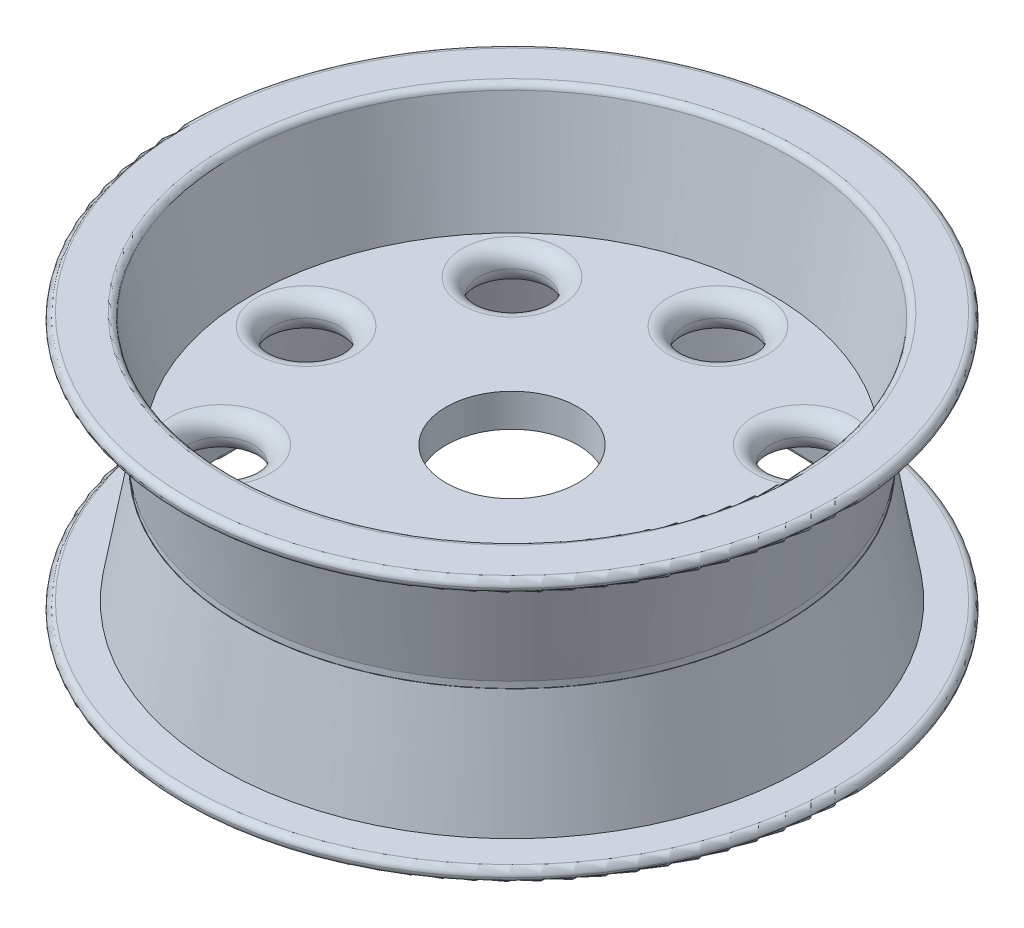
ISO-10303-21;
HEADER;
FILE_DESCRIPTION(('STEP AP214'),'2;1');
FILE_NAME('part.step','',(''),(''),'','','');
FILE_SCHEMA(('AUTOMOTIVE_DESIGN { 1 0 10303 214 1 1 1 1 }'));
ENDSEC;
DATA;
#1=APPLICATION_CONTEXT('core data for automotive mechanical design processes');
#2=APPLICATION_PROTOCOL_DEFINITION('international standard','automotive_design',2000,#1);
#3=PRODUCT_CONTEXT('',#1,'mechanical');
#4=PRODUCT('Part','Part','',(#3));
#5=PRODUCT_RELATED_PRODUCT_CATEGORY('part','',(#4));
#6=PRODUCT_DEFINITION_FORMATION('','',#4);
#7=PRODUCT_DEFINITION_CONTEXT('part definition',#1,'design');
#8=PRODUCT_DEFINITION('design','',#6,#7);
#9=PRODUCT_DEFINITION_SHAPE('','',#8);
#10=(LENGTH_UNIT() NAMED_UNIT(*) SI_UNIT(.MILLI.,.METRE.));
#11=(NAMED_UNIT(*) PLANE_ANGLE_UNIT() SI_UNIT($,.RADIAN.));
#12=(NAMED_UNIT(*) SI_UNIT($,.STERADIAN.) SOLID_ANGLE_UNIT());
#13=UNCERTAINTY_MEASURE_WITH_UNIT(LENGTH_MEASURE(1.E-05),#10,'distance_accuracy_value','');
#14=(GEOMETRIC_REPRESENTATION_CONTEXT(3) GLOBAL_UNCERTAINTY_ASSIGNED_CONTEXT((#13)) GLOBAL_UNIT_ASSIGNED_CONTEXT((#10,
#11,#12)) REPRESENTATION_CONTEXT('',''));
#15=CARTESIAN_POINT('',(0.,0.,0.));
#16=DIRECTION('',(0.,0.,1.));
#17=DIRECTION('',(1.,0.,0.));
#18=AXIS2_PLACEMENT_3D('',#15,#16,#17);
#19=CARTESIAN_POINT('',(100.,41.,0.));
#20=DIRECTION('',(0.,1.,0.));
#21=DIRECTION('',(0.,0.,1.));
#22=AXIS2_PLACEMENT_3D('',#19,#20,#21);
#23=PLANE('',#22);
#24=CARTESIAN_POINT('',(100.,41.,0.));
#25=DIRECTION('',(0.,1.,0.));
#26=DIRECTION('',(0.,0.,1.));
#27=AXIS2_PLACEMENT_3D('',#24,#25,#26);
#28=CIRCLE('',#27,82.1849541999128);
#29=CARTESIAN_POINT('',(100.,41.,82.1849541999128));
#30=VERTEX_POINT('',#29);
#31=EDGE_CURVE('E173',#30,#30,#28,.T.);
#32=ORIENTED_EDGE('',*,*,#31,.F.);
#33=EDGE_LOOP('',(#32));
#34=FACE_BOUND('',#33,.T.);
#35=CARTESIAN_POINT('',(100.,40.9999999999968,0.));
#36=DIRECTION('',(0.,1.,0.));
#37=DIRECTION('',(0.,0.,1.));
#38=AXIS2_PLACEMENT_3D('',#35,#36,#37);
#39=CIRCLE('',#38,82.04866226769);
#40=CARTESIAN_POINT('',(100.,40.9999999999968,82.04866226769));
#41=VERTEX_POINT('',#40);
#42=EDGE_CURVE('E155',#41,#41,#39,.F.);
#43=ORIENTED_EDGE('',*,*,#42,.F.);
#44=EDGE_LOOP('',(#43));
#45=FACE_BOUND('',#44,.T.);
#46=ADVANCED_FACE('F44',(#34,#45),#23,.F.);
#47=CARTESIAN_POINT('',(100.,39.,0.));
#48=DIRECTION('',(0.,-1.,0.));
#49=DIRECTION('',(0.,0.,-1.));
#50=AXIS2_PLACEMENT_3D('',#47,#48,#49);
#51=PLANE('',#50);
#52=CARTESIAN_POINT('',(100.,39.,0.));
#53=DIRECTION('',(0.,-1.,0.));
#54=DIRECTION('',(0.,0.,-1.));
#55=AXIS2_PLACEMENT_3D('',#52,#53,#54);
#56=CIRCLE('',#55,82.1849541999128);
#57=CARTESIAN_POINT('',(100.,39.,-82.1849541999128));
#58=VERTEX_POINT('',#57);
#59=EDGE_CURVE('E177',#58,#58,#56,.T.);
#60=ORIENTED_EDGE('',*,*,#59,.F.);
#61=EDGE_LOOP('',(#60));
#62=FACE_BOUND('',#61,.T.);
#63=CARTESIAN_POINT('',(100.,38.9999999999873,0.));
#64=DIRECTION('',(0.,-1.,0.));
#65=DIRECTION('',(0.,0.,-1.));
#66=AXIS2_PLACEMENT_3D('',#63,#64,#65);
#67=CIRCLE('',#66,82.04866226769);
#68=CARTESIAN_POINT('',(100.,38.9999999999873,-82.04866226769));
#69=VERTEX_POINT('',#68);
#70=EDGE_CURVE('E158',#69,#69,#67,.F.);
#71=ORIENTED_EDGE('',*,*,#70,.F.);
#72=EDGE_LOOP('',(#71));
#73=FACE_BOUND('',#72,.T.);
#74=ADVANCED_FACE('F190',(#62,#73),#51,.F.);
#75=CARTESIAN_POINT('',(100.,80.,0.));
#76=DIRECTION('',(0.,-1.,0.));
#77=DIRECTION('',(0.,0.,-1.));
#78=AXIS2_PLACEMENT_3D('',#75,#76,#77);
#79=CYLINDRICAL_SURFACE('',#78,20.);
#80=CARTESIAN_POINT('',(100.,45.,0.));
#81=DIRECTION('',(0.,1.,0.));
#82=DIRECTION('',(0.,0.,1.));
#83=AXIS2_PLACEMENT_3D('',#80,#81,#82);
#84=CIRCLE('',#83,20.);
#85=CARTESIAN_POINT('',(100.,45.,20.));
#86=VERTEX_POINT('',#85);
#87=EDGE_CURVE('E161',#86,#86,#84,.T.);
#88=ORIENTED_EDGE('',*,*,#87,.T.);
#89=EDGE_LOOP('',(#88));
#90=FACE_BOUND('',#89,.T.);
#91=CARTESIAN_POINT('',(100.,35.,0.));
#92=DIRECTION('',(0.,-1.,0.));
#93=DIRECTION('',(0.,0.,-1.));
#94=AXIS2_PLACEMENT_3D('',#91,#92,#93);
#95=CIRCLE('',#94,20.);
#96=CARTESIAN_POINT('',(100.,35.,-20.));
#97=VERTEX_POINT('',#96);
#98=EDGE_CURVE('E167',#97,#97,#95,.T.);
#99=ORIENTED_EDGE('',*,*,#98,.T.);
#100=EDGE_LOOP('',(#99));
#101=FACE_BOUND('',#100,.T.);
#102=ADVANCED_FACE('F203',(#90,#101),#79,.F.);
#103=CARTESIAN_POINT('',(100.,80.,0.));
#104=DIRECTION('',(0.,1.,0.));
#105=DIRECTION('',(0.,0.,1.));
#106=AXIS2_PLACEMENT_3D('',#103,#104,#105);
#107=PLANE('',#106);
#108=CARTESIAN_POINT('',(100.,80.,0.));
#109=DIRECTION('',(0.,1.,0.));
#110=DIRECTION('',(0.,0.,1.));
#111=AXIS2_PLACEMENT_3D('',#108,#109,#110);
#112=CIRCLE('',#111,86.6781992623545);
#113=CARTESIAN_POINT('',(100.,80.,86.6781992623545));
#114=VERTEX_POINT('',#113);
#115=EDGE_CURVE('E12',#114,#114,#112,.F.);
#116=ORIENTED_EDGE('',*,*,#115,.T.);
#117=EDGE_LOOP('',(#116));
#118=FACE_BOUND('',#117,.T.);
#119=CARTESIAN_POINT('',(100.,80.,0.));
#120=DIRECTION('',(0.,1.,0.));
#121=DIRECTION('',(0.,0.,1.));
#122=AXIS2_PLACEMENT_3D('',#119,#120,#121);
#123=CIRCLE('',#122,98.);
#124=CARTESIAN_POINT('',(100.,80.,98.));
#125=VERTEX_POINT('',#124);
#126=EDGE_CURVE('E152',#125,#125,#123,.T.);
#127=ORIENTED_EDGE('',*,*,#126,.T.);
#128=EDGE_LOOP('',(#127));
#129=FACE_BOUND('',#128,.T.);
#130=ADVANCED_FACE('F209',(#118,#129),#107,.T.);
#131=CARTESIAN_POINT('',(100.,0.,0.));
#132=DIRECTION('',(0.,1.,0.));
#133=DIRECTION('',(0.,0.,1.));
#134=AXIS2_PLACEMENT_3D('',#131,#132,#133);
#135=PLANE('',#134);
#136=CARTESIAN_POINT('',(100.,0.,0.));
#137=DIRECTION('',(0.,1.,0.));
#138=DIRECTION('',(0.,0.,1.));
#139=AXIS2_PLACEMENT_3D('',#136,#137,#138);
#140=CIRCLE('',#139,86.6781992623545);
#141=CARTESIAN_POINT('',(100.,0.,86.6781992623545));
#142=VERTEX_POINT('',#141);
#143=EDGE_CURVE('E55',#142,#142,#140,.T.);
#144=ORIENTED_EDGE('',*,*,#143,.T.);
#145=EDGE_LOOP('',(#144));
#146=FACE_BOUND('',#145,.T.);
#147=CARTESIAN_POINT('',(100.,0.,0.));
#148=DIRECTION('',(0.,1.,0.));
#149=DIRECTION('',(0.,0.,1.));
#150=AXIS2_PLACEMENT_3D('',#147,#148,#149);
#151=CIRCLE('',#150,98.);
#152=CARTESIAN_POINT('',(100.,0.,98.));
#153=VERTEX_POINT('',#152);
#154=EDGE_CURVE('E137',#153,#153,#151,.F.);
#155=ORIENTED_EDGE('',*,*,#154,.T.);
#156=EDGE_LOOP('',(#155));
#157=FACE_BOUND('',#156,.T.);
#158=ADVANCED_FACE('F230',(#146,#157),#135,.F.);
#159=CARTESIAN_POINT('',(100.,80.,0.));
#160=DIRECTION('',(0.,1.,0.));
#161=DIRECTION('',(0.,0.,1.));
#162=AXIS2_PLACEMENT_3D('',#159,#160,#161);
#163=CONICAL_SURFACE('',#162,85.,0.174532925199433);
#164=CARTESIAN_POINT('',(100.,78.3472963553339,0.));
#165=DIRECTION('',(0.,1.,0.));
#166=DIRECTION('',(0.,0.,1.));
#167=AXIS2_PLACEMENT_3D('',#164,#165,#166);
#168=CIRCLE('',#167,84.7085837563301);
#169=CARTESIAN_POINT('',(100.,78.3472963553339,84.7085837563301));
#170=VERTEX_POINT('',#169);
#171=EDGE_CURVE('E51',#170,#170,#168,.T.);
#172=ORIENTED_EDGE('',*,*,#171,.T.);
#173=EDGE_LOOP('',(#172));
#174=FACE_BOUND('',#173,.T.);
#175=CARTESIAN_POINT('',(100.,45.,0.));
#176=DIRECTION('',(0.,1.,0.));
#177=DIRECTION('',(0.,0.,1.));
#178=AXIS2_PLACEMENT_3D('',#175,#176,#177);
#179=CIRCLE('',#178,78.8285556752037);
#180=CARTESIAN_POINT('',(100.,45.,78.8285556752037));
#181=VERTEX_POINT('',#180);
#182=EDGE_CURVE('E164',#181,#181,#179,.T.);
#183=ORIENTED_EDGE('',*,*,#182,.F.);
#184=EDGE_LOOP('',(#183));
#185=FACE_BOUND('',#184,.T.);
#186=ADVANCED_FACE('F227',(#174,#185),#163,.F.);
#187=CARTESIAN_POINT('',(100.,45.,0.));
#188=DIRECTION('',(0.,1.,0.));
#189=DIRECTION('',(0.,0.,1.));
#190=AXIS2_PLACEMENT_3D('',#187,#188,#189);
#191=PLANE('',#190);
#192=CARTESIAN_POINT('',(100.,45.,-62.5));
#193=DIRECTION('',(0.,1.,0.));
#194=DIRECTION('',(0.,0.,1.));
#195=AXIS2_PLACEMENT_3D('',#192,#193,#194);
#196=CIRCLE('',#195,15.);
#197=CARTESIAN_POINT('',(100.,45.,-47.5));
#198=VERTEX_POINT('',#197);
#199=EDGE_CURVE('E64',#198,#198,#196,.F.);
#200=ORIENTED_EDGE('',*,*,#199,.T.);
#201=EDGE_LOOP('',(#200));
#202=FACE_BOUND('',#201,.T.);
#203=CARTESIAN_POINT('',(55.8058261758416,45.,-44.1941738241591));
#204=DIRECTION('',(0.,1.,0.));
#205=DIRECTION('',(0.,0.,1.));
#206=AXIS2_PLACEMENT_3D('',#203,#204,#205);
#207=CIRCLE('',#206,15.);
#208=CARTESIAN_POINT('',(55.8058261758416,45.,-29.1941738241591));
#209=VERTEX_POINT('',#208);
#210=EDGE_CURVE('E92',#209,#209,#207,.F.);
#211=ORIENTED_EDGE('',*,*,#210,.T.);
#212=EDGE_LOOP('',(#211));
#213=FACE_BOUND('',#212,.T.);
#214=CARTESIAN_POINT('',(37.5000000000009,45.,2.22044604925031E-13));
#215=DIRECTION('',(0.,1.,0.));
#216=DIRECTION('',(0.,0.,1.));
#217=AXIS2_PLACEMENT_3D('',#214,#215,#216);
#218=CIRCLE('',#217,15.);
#219=CARTESIAN_POINT('',(37.5000000000009,45.,15.0000000000002));
#220=VERTEX_POINT('',#219);
#221=EDGE_CURVE('E95',#220,#220,#218,.F.);
#222=ORIENTED_EDGE('',*,*,#221,.T.);
#223=EDGE_LOOP('',(#222));
#224=FACE_BOUND('',#223,.T.);
#225=CARTESIAN_POINT('',(55.8058261758419,45.,44.1941738241594));
#226=DIRECTION('',(0.,1.,0.));
#227=DIRECTION('',(0.,0.,1.));
#228=AXIS2_PLACEMENT_3D('',#225,#226,#227);
#229=CIRCLE('',#228,15.);
#230=CARTESIAN_POINT('',(55.8058261758419,45.,59.1941738241594));
#231=VERTEX_POINT('',#230);
#232=EDGE_CURVE('E98',#231,#231,#229,.F.);
#233=ORIENTED_EDGE('',*,*,#232,.T.);
#234=EDGE_LOOP('',(#233));
#235=FACE_BOUND('',#234,.T.);
#236=CARTESIAN_POINT('',(162.500000000001,45.,-6.66133814775094E-13));
#237=DIRECTION('',(0.,1.,0.));
#238=DIRECTION('',(0.,0.,1.));
#239=AXIS2_PLACEMENT_3D('',#236,#237,#238);
#240=CIRCLE('',#239,15.);
#241=CARTESIAN_POINT('',(162.500000000001,45.,14.9999999999993));
#242=VERTEX_POINT('',#241);
#243=EDGE_CURVE('E101',#242,#242,#240,.F.);
#244=ORIENTED_EDGE('',*,*,#243,.T.);
#245=EDGE_LOOP('',(#244));
#246=FACE_BOUND('',#245,.T.);
#247=CARTESIAN_POINT('',(100.000000000001,45.,62.5));
#248=DIRECTION('',(0.,1.,0.));
#249=DIRECTION('',(0.,0.,1.));
#250=AXIS2_PLACEMENT_3D('',#247,#248,#249);
#251=CIRCLE('',#250,15.);
#252=CARTESIAN_POINT('',(100.000000000001,45.,77.5));
#253=VERTEX_POINT('',#252);
#254=EDGE_CURVE('E104',#253,#253,#251,.F.);
#255=ORIENTED_EDGE('',*,*,#254,.T.);
#256=EDGE_LOOP('',(#255));
#257=FACE_BOUND('',#256,.T.);
#258=CARTESIAN_POINT('',(144.19417382416,45.,-44.1941738241598));
#259=DIRECTION('',(0.,1.,0.));
#260=DIRECTION('',(0.,0.,1.));
#261=AXIS2_PLACEMENT_3D('',#258,#259,#260);
#262=CIRCLE('',#261,15.);
#263=CARTESIAN_POINT('',(144.19417382416,45.,-29.1941738241598));
#264=VERTEX_POINT('',#263);
#265=EDGE_CURVE('E107',#264,#264,#262,.F.);
#266=ORIENTED_EDGE('',*,*,#265,.T.);
#267=EDGE_LOOP('',(#266));
#268=FACE_BOUND('',#267,.T.);
#269=CARTESIAN_POINT('',(144.194173824161,45.,44.1941738241588));
#270=DIRECTION('',(0.,1.,0.));
#271=DIRECTION('',(0.,0.,1.));
#272=AXIS2_PLACEMENT_3D('',#269,#270,#271);
#273=CIRCLE('',#272,15.);
#274=CARTESIAN_POINT('',(144.194173824161,45.,59.1941738241588));
#275=VERTEX_POINT('',#274);
#276=EDGE_CURVE('E110',#275,#275,#273,.F.);
#277=ORIENTED_EDGE('',*,*,#276,.T.);
#278=EDGE_LOOP('',(#277));
#279=FACE_BOUND('',#278,.T.);
#280=ORIENTED_EDGE('',*,*,#87,.F.);
#281=EDGE_LOOP('',(#280));
#282=FACE_BOUND('',#281,.T.);
#283=ORIENTED_EDGE('',*,*,#182,.T.);
#284=EDGE_LOOP('',(#283));
#285=FACE_BOUND('',#284,.T.);
#286=ADVANCED_FACE('F223',(#202,#213,#224,#235,#246,#257,#268,#279,#282,#285),#191,.T.);
#287=CARTESIAN_POINT('',(100.,0.,0.));
#288=DIRECTION('',(0.,-1.,0.));
#289=DIRECTION('',(0.,0.,-1.));
#290=AXIS2_PLACEMENT_3D('',#287,#288,#289);
#291=CONICAL_SURFACE('',#290,85.,0.174532925199433);
#292=CARTESIAN_POINT('',(100.,1.65270364466608,0.));
#293=DIRECTION('',(0.,1.,0.));
#294=DIRECTION('',(0.,0.,1.));
#295=AXIS2_PLACEMENT_3D('',#292,#293,#294);
#296=CIRCLE('',#295,84.7085837563301);
#297=CARTESIAN_POINT('',(100.,1.65270364466608,84.7085837563301));
#298=VERTEX_POINT('',#297);
#299=EDGE_CURVE('E59',#298,#298,#296,.F.);
#300=ORIENTED_EDGE('',*,*,#299,.T.);
#301=EDGE_LOOP('',(#300));
#302=FACE_BOUND('',#301,.T.);
#303=CARTESIAN_POINT('',(100.,35.,0.));
#304=DIRECTION('',(0.,-1.,0.));
#305=DIRECTION('',(0.,0.,-1.));
#306=AXIS2_PLACEMENT_3D('',#303,#304,#305);
#307=CIRCLE('',#306,78.8285556752037);
#308=CARTESIAN_POINT('',(100.,35.,-78.8285556752037));
#309=VERTEX_POINT('',#308);
#310=EDGE_CURVE('E170',#309,#309,#307,.T.);
#311=ORIENTED_EDGE('',*,*,#310,.F.);
#312=EDGE_LOOP('',(#311));
#313=FACE_BOUND('',#312,.T.);
#314=ADVANCED_FACE('F219',(#302,#313),#291,.F.);
#315=CARTESIAN_POINT('',(100.,35.,0.));
#316=DIRECTION('',(0.,-1.,0.));
#317=DIRECTION('',(0.,0.,-1.));
#318=AXIS2_PLACEMENT_3D('',#315,#316,#317);
#319=PLANE('',#318);
#320=CARTESIAN_POINT('',(100.,35.,-62.5));
#321=DIRECTION('',(0.,-1.,0.));
#322=DIRECTION('',(0.,0.,-1.));
#323=AXIS2_PLACEMENT_3D('',#320,#321,#322);
#324=CIRCLE('',#323,15.);
#325=CARTESIAN_POINT('',(100.,35.,-77.5));
#326=VERTEX_POINT('',#325);
#327=EDGE_CURVE('E113',#326,#326,#324,.F.);
#328=ORIENTED_EDGE('',*,*,#327,.T.);
#329=EDGE_LOOP('',(#328));
#330=FACE_BOUND('',#329,.T.);
#331=CARTESIAN_POINT('',(55.8058261758416,35.,-44.1941738241591));
#332=DIRECTION('',(0.,-1.,0.));
#333=DIRECTION('',(0.,0.,-1.));
#334=AXIS2_PLACEMENT_3D('',#331,#332,#333);
#335=CIRCLE('',#334,15.);
#336=CARTESIAN_POINT('',(55.8058261758416,35.,-59.1941738241591));
#337=VERTEX_POINT('',#336);
#338=EDGE_CURVE('E116',#337,#337,#335,.F.);
#339=ORIENTED_EDGE('',*,*,#338,.T.);
#340=EDGE_LOOP('',(#339));
#341=FACE_BOUND('',#340,.T.);
#342=CARTESIAN_POINT('',(37.5000000000009,35.,2.22044604925031E-13));
#343=DIRECTION('',(0.,-1.,0.));
#344=DIRECTION('',(0.,0.,-1.));
#345=AXIS2_PLACEMENT_3D('',#342,#343,#344);
#346=CIRCLE('',#345,15.);
#347=CARTESIAN_POINT('',(37.5000000000009,35.,-14.9999999999998));
#348=VERTEX_POINT('',#347);
#349=EDGE_CURVE('E119',#348,#348,#346,.F.);
#350=ORIENTED_EDGE('',*,*,#349,.T.);
#351=EDGE_LOOP('',(#350));
#352=FACE_BOUND('',#351,.T.);
#353=CARTESIAN_POINT('',(55.8058261758419,35.,44.1941738241594));
#354=DIRECTION('',(0.,-1.,0.));
#355=DIRECTION('',(0.,0.,-1.));
#356=AXIS2_PLACEMENT_3D('',#353,#354,#355);
#357=CIRCLE('',#356,15.);
#358=CARTESIAN_POINT('',(55.8058261758419,35.,29.1941738241595));
#359=VERTEX_POINT('',#358);
#360=EDGE_CURVE('E122',#359,#359,#357,.F.);
#361=ORIENTED_EDGE('',*,*,#360,.T.);
#362=EDGE_LOOP('',(#361));
#363=FACE_BOUND('',#362,.T.);
#364=CARTESIAN_POINT('',(162.500000000001,35.,-6.66133814775094E-13));
#365=DIRECTION('',(0.,-1.,0.));
#366=DIRECTION('',(0.,0.,-1.));
#367=AXIS2_PLACEMENT_3D('',#364,#365,#366);
#368=CIRCLE('',#367,15.);
#369=CARTESIAN_POINT('',(162.500000000001,35.,-15.0000000000006));
#370=VERTEX_POINT('',#369);
#371=EDGE_CURVE('E125',#370,#370,#368,.F.);
#372=ORIENTED_EDGE('',*,*,#371,.T.);
#373=EDGE_LOOP('',(#372));
#374=FACE_BOUND('',#373,.T.);
#375=CARTESIAN_POINT('',(100.000000000001,35.,62.5));
#376=DIRECTION('',(0.,-1.,0.));
#377=DIRECTION('',(0.,0.,-1.));
#378=AXIS2_PLACEMENT_3D('',#375,#376,#377);
#379=CIRCLE('',#378,15.);
#380=CARTESIAN_POINT('',(100.000000000001,35.,47.5));
#381=VERTEX_POINT('',#380);
#382=EDGE_CURVE('E128',#381,#381,#379,.F.);
#383=ORIENTED_EDGE('',*,*,#382,.T.);
#384=EDGE_LOOP('',(#383));
#385=FACE_BOUND('',#384,.T.);
#386=CARTESIAN_POINT('',(144.19417382416,35.,-44.1941738241598));
#387=DIRECTION('',(0.,-1.,0.));
#388=DIRECTION('',(0.,0.,-1.));
#389=AXIS2_PLACEMENT_3D('',#386,#387,#388);
#390=CIRCLE('',#389,15.);
#391=CARTESIAN_POINT('',(144.19417382416,35.,-59.1941738241598));
#392=VERTEX_POINT('',#391);
#393=EDGE_CURVE('E131',#392,#392,#390,.F.);
#394=ORIENTED_EDGE('',*,*,#393,.T.);
#395=EDGE_LOOP('',(#394));
#396=FACE_BOUND('',#395,.T.);
#397=CARTESIAN_POINT('',(144.194173824161,35.,44.1941738241588));
#398=DIRECTION('',(0.,-1.,0.));
#399=DIRECTION('',(0.,0.,-1.));
#400=AXIS2_PLACEMENT_3D('',#397,#398,#399);
#401=CIRCLE('',#400,15.);
#402=CARTESIAN_POINT('',(144.194173824161,35.,29.1941738241588));
#403=VERTEX_POINT('',#402);
#404=EDGE_CURVE('E134',#403,#403,#401,.F.);
#405=ORIENTED_EDGE('',*,*,#404,.T.);
#406=EDGE_LOOP('',(#405));
#407=FACE_BOUND('',#406,.T.);
#408=ORIENTED_EDGE('',*,*,#98,.F.);
#409=EDGE_LOOP('',(#408));
#410=FACE_BOUND('',#409,.T.);
#411=ORIENTED_EDGE('',*,*,#310,.T.);
#412=EDGE_LOOP('',(#411));
#413=FACE_BOUND('',#412,.T.);
#414=ADVANCED_FACE('F215',(#330,#341,#352,#363,#374,#385,#396,#407,#410,#413),#319,.T.);
#415=CARTESIAN_POINT('',(100.,76.,0.));
#416=DIRECTION('',(0.,1.,0.));
#417=DIRECTION('',(0.,0.,1.));
#418=AXIS2_PLACEMENT_3D('',#415,#416,#417);
#419=PLANE('',#418);
#420=CARTESIAN_POINT('',(100.,76.,0.));
#421=DIRECTION('',(0.,1.,0.));
#422=DIRECTION('',(0.,0.,1.));
#423=AXIS2_PLACEMENT_3D('',#420,#421,#422);
#424=CIRCLE('',#423,98.);
#425=CARTESIAN_POINT('',(100.,76.,98.));
#426=VERTEX_POINT('',#425);
#427=EDGE_CURVE('E149',#426,#426,#424,.F.);
#428=ORIENTED_EDGE('',*,*,#427,.T.);
#429=EDGE_LOOP('',(#428));
#430=FACE_BOUND('',#429,.T.);
#431=CARTESIAN_POINT('',(100.,76.,0.));
#432=DIRECTION('',(0.,1.,0.));
#433=DIRECTION('',(0.,0.,1.));
#434=AXIS2_PLACEMENT_3D('',#431,#432,#433);
#435=CIRCLE('',#434,88.3563985247091);
#436=CARTESIAN_POINT('',(100.,76.,88.3563985247091));
#437=VERTEX_POINT('',#436);
#438=EDGE_CURVE('E174',#437,#437,#435,.T.);
#439=ORIENTED_EDGE('',*,*,#438,.T.);
#440=EDGE_LOOP('',(#439));
#441=FACE_BOUND('',#440,.T.);
#442=ADVANCED_FACE('F218',(#430,#441),#419,.F.);
#443=CARTESIAN_POINT('',(100.,4.,0.));
#444=DIRECTION('',(0.,1.,0.));
#445=DIRECTION('',(0.,0.,1.));
#446=AXIS2_PLACEMENT_3D('',#443,#444,#445);
#447=PLANE('',#446);
#448=CARTESIAN_POINT('',(100.,4.,0.));
#449=DIRECTION('',(0.,1.,0.));
#450=DIRECTION('',(0.,0.,1.));
#451=AXIS2_PLACEMENT_3D('',#448,#449,#450);
#452=CIRCLE('',#451,98.);
#453=CARTESIAN_POINT('',(100.,4.,98.));
#454=VERTEX_POINT('',#453);
#455=EDGE_CURVE('E146',#454,#454,#452,.T.);
#456=ORIENTED_EDGE('',*,*,#455,.T.);
#457=EDGE_LOOP('',(#456));
#458=FACE_BOUND('',#457,.T.);
#459=CARTESIAN_POINT('',(100.,4.,0.));
#460=DIRECTION('',(0.,1.,0.));
#461=DIRECTION('',(0.,0.,1.));
#462=AXIS2_PLACEMENT_3D('',#459,#460,#461);
#463=CIRCLE('',#462,88.3563985247091);
#464=CARTESIAN_POINT('',(100.,4.,88.3563985247091));
#465=VERTEX_POINT('',#464);
#466=EDGE_CURVE('E143',#465,#465,#463,.F.);
#467=ORIENTED_EDGE('',*,*,#466,.T.);
#468=EDGE_LOOP('',(#467));
#469=FACE_BOUND('',#468,.T.);
#470=ADVANCED_FACE('F335',(#458,#469),#447,.T.);
#471=CARTESIAN_POINT('',(100.,79.3054072893323,0.));
#472=DIRECTION('',(0.,1.,0.));
#473=DIRECTION('',(0.,0.,1.));
#474=AXIS2_PLACEMENT_3D('',#471,#472,#473);
#475=CONICAL_SURFACE('',#474,88.9392310120488,0.174532925199433);
#476=ORIENTED_EDGE('',*,*,#31,.T.);
#477=EDGE_LOOP('',(#476));
#478=FACE_BOUND('',#477,.T.);
#479=ORIENTED_EDGE('',*,*,#438,.F.);
#480=EDGE_LOOP('',(#479));
#481=FACE_BOUND('',#480,.T.);
#482=ADVANCED_FACE('F185',(#478,#481),#475,.T.);
#483=CARTESIAN_POINT('',(100.,0.694592710667723,0.));
#484=DIRECTION('',(0.,-1.,0.));
#485=DIRECTION('',(0.,0.,-1.));
#486=AXIS2_PLACEMENT_3D('',#483,#484,#485);
#487=CONICAL_SURFACE('',#486,88.9392310120488,0.174532925199433);
#488=ORIENTED_EDGE('',*,*,#59,.T.);
#489=EDGE_LOOP('',(#488));
#490=FACE_BOUND('',#489,.T.);
#491=ORIENTED_EDGE('',*,*,#466,.F.);
#492=EDGE_LOOP('',(#491));
#493=FACE_BOUND('',#492,.T.);
#494=ADVANCED_FACE('F198',(#490,#493),#487,.T.);
#495=CARTESIAN_POINT('',(100.,-500000.,0.));
#496=DIRECTION('',(0.,1.,0.));
#497=DIRECTION('',(0.,0.,1.));
#498=AXIS2_PLACEMENT_3D('',#495,#496,#497);
#499=CYLINDRICAL_SURFACE('',#498,82.04866226769);
#500=ORIENTED_EDGE('',*,*,#42,.T.);
#501=EDGE_LOOP('',(#500));
#502=FACE_BOUND('',#501,.T.);
#503=ORIENTED_EDGE('',*,*,#70,.T.);
#504=EDGE_LOOP('',(#503));
#505=FACE_BOUND('',#504,.T.);
#506=ADVANCED_FACE('F194',(#502,#505),#499,.T.);
#507=CARTESIAN_POINT('',(100.,78.,0.));
#508=DIRECTION('',(0.,1.,0.));
#509=DIRECTION('',(0.,0.,1.));
#510=AXIS2_PLACEMENT_3D('',#507,#508,#509);
#511=TOROIDAL_SURFACE('',#510,98.,2.);
#512=ORIENTED_EDGE('',*,*,#427,.F.);
#513=EDGE_LOOP('',(#512));
#514=FACE_BOUND('',#513,.T.);
#515=CARTESIAN_POINT('',(100.,78.,0.));
#516=DIRECTION('',(0.,1.,0.));
#517=DIRECTION('',(0.,0.,1.));
#518=AXIS2_PLACEMENT_3D('',#515,#516,#517);
#519=CIRCLE('',#518,100.);
#520=CARTESIAN_POINT('',(100.,78.,100.));
#521=VERTEX_POINT('',#520);
#522=EDGE_CURVE('E140',#521,#521,#519,.T.);
#523=ORIENTED_EDGE('',*,*,#522,.F.);
#524=EDGE_LOOP('',(#523));
#525=FACE_BOUND('',#524,.T.);
#526=ADVANCED_FACE('F197',(#514,#525),#511,.T.);
#527=CARTESIAN_POINT('',(100.,78.,0.));
#528=DIRECTION('',(0.,1.,0.));
#529=DIRECTION('',(0.,0.,1.));
#530=AXIS2_PLACEMENT_3D('',#527,#528,#529);
#531=TOROIDAL_SURFACE('',#530,98.,2.);
#532=ORIENTED_EDGE('',*,*,#522,.T.);
#533=EDGE_LOOP('',(#532));
#534=FACE_BOUND('',#533,.T.);
#535=ORIENTED_EDGE('',*,*,#126,.F.);
#536=EDGE_LOOP('',(#535));
#537=FACE_BOUND('',#536,.T.);
#538=ADVANCED_FACE('F237',(#534,#537),#531,.T.);
#539=CARTESIAN_POINT('',(100.,2.,0.));
#540=DIRECTION('',(0.,1.,0.));
#541=DIRECTION('',(0.,0.,1.));
#542=AXIS2_PLACEMENT_3D('',#539,#540,#541);
#543=TOROIDAL_SURFACE('',#542,98.,2.);
#544=ORIENTED_EDGE('',*,*,#154,.F.);
#545=EDGE_LOOP('',(#544));
#546=FACE_BOUND('',#545,.T.);
#547=CARTESIAN_POINT('',(100.,2.,0.));
#548=DIRECTION('',(0.,1.,0.));
#549=DIRECTION('',(0.,0.,1.));
#550=AXIS2_PLACEMENT_3D('',#547,#548,#549);
#551=CIRCLE('',#550,100.);
#552=CARTESIAN_POINT('',(100.,2.,100.));
#553=VERTEX_POINT('',#552);
#554=EDGE_CURVE('E89',#553,#553,#551,.T.);
#555=ORIENTED_EDGE('',*,*,#554,.F.);
#556=EDGE_LOOP('',(#555));
#557=FACE_BOUND('',#556,.T.);
#558=ADVANCED_FACE('F240',(#546,#557),#543,.T.);
#559=CARTESIAN_POINT('',(100.,2.,0.));
#560=DIRECTION('',(0.,1.,0.));
#561=DIRECTION('',(0.,0.,1.));
#562=AXIS2_PLACEMENT_3D('',#559,#560,#561);
#563=TOROIDAL_SURFACE('',#562,98.,2.);
#564=ORIENTED_EDGE('',*,*,#554,.T.);
#565=EDGE_LOOP('',(#564));
#566=FACE_BOUND('',#565,.T.);
#567=ORIENTED_EDGE('',*,*,#455,.F.);
#568=EDGE_LOOP('',(#567));
#569=FACE_BOUND('',#568,.T.);
#570=ADVANCED_FACE('F245',(#566,#569),#563,.T.);
#571=CARTESIAN_POINT('',(100.,40.,-62.5));
#572=DIRECTION('',(0.,1.,0.));
#573=DIRECTION('',(0.,0.,1.));
#574=AXIS2_PLACEMENT_3D('',#571,#572,#573);
#575=TOROIDAL_SURFACE('',#574,15.,5.);
#576=ORIENTED_EDGE('',*,*,#199,.F.);
#577=EDGE_LOOP('',(#576));
#578=FACE_BOUND('',#577,.T.);
#579=CARTESIAN_POINT('',(100.,40.,-62.5));
#580=DIRECTION('',(0.,1.,0.));
#581=DIRECTION('',(0.,0.,1.));
#582=AXIS2_PLACEMENT_3D('',#579,#580,#581);
#583=CIRCLE('',#582,9.99999999999999);
#584=CARTESIAN_POINT('',(100.,40.,-52.5));
#585=VERTEX_POINT('',#584);
#586=EDGE_CURVE('E86',#585,#585,#583,.T.);
#587=ORIENTED_EDGE('',*,*,#586,.F.);
#588=EDGE_LOOP('',(#587));
#589=FACE_BOUND('',#588,.T.);
#590=ADVANCED_FACE('F248',(#578,#589),#575,.T.);
#591=CARTESIAN_POINT('',(100.,40.,-62.5));
#592=DIRECTION('',(0.,-1.,0.));
#593=DIRECTION('',(0.,0.,-1.));
#594=AXIS2_PLACEMENT_3D('',#591,#592,#593);
#595=TOROIDAL_SURFACE('',#594,15.,5.);
#596=ORIENTED_EDGE('',*,*,#327,.F.);
#597=EDGE_LOOP('',(#596));
#598=FACE_BOUND('',#597,.T.);
#599=ORIENTED_EDGE('',*,*,#586,.T.);
#600=EDGE_LOOP('',(#599));
#601=FACE_BOUND('',#600,.T.);
#602=ADVANCED_FACE('F253',(#598,#601),#595,.T.);
#603=CARTESIAN_POINT('',(55.8058261758416,40.,-44.1941738241591));
#604=DIRECTION('',(0.,1.,0.));
#605=DIRECTION('',(0.,0.,1.));
#606=AXIS2_PLACEMENT_3D('',#603,#604,#605);
#607=TOROIDAL_SURFACE('',#606,15.,5.);
#608=ORIENTED_EDGE('',*,*,#210,.F.);
#609=EDGE_LOOP('',(#608));
#610=FACE_BOUND('',#609,.T.);
#611=CARTESIAN_POINT('',(55.8058261758416,40.,-44.1941738241591));
#612=DIRECTION('',(0.,1.,0.));
#613=DIRECTION('',(0.,0.,1.));
#614=AXIS2_PLACEMENT_3D('',#611,#612,#613);
#615=CIRCLE('',#614,10.);
#616=CARTESIAN_POINT('',(55.8058261758416,40.,-34.1941738241591));
#617=VERTEX_POINT('',#616);
#618=EDGE_CURVE('E83',#617,#617,#615,.T.);
#619=ORIENTED_EDGE('',*,*,#618,.F.);
#620=EDGE_LOOP('',(#619));
#621=FACE_BOUND('',#620,.T.);
#622=ADVANCED_FACE('F256',(#610,#621),#607,.T.);
#623=CARTESIAN_POINT('',(55.8058261758416,40.,-44.1941738241591));
#624=DIRECTION('',(0.,-1.,0.));
#625=DIRECTION('',(0.,0.,-1.));
#626=AXIS2_PLACEMENT_3D('',#623,#624,#625);
#627=TOROIDAL_SURFACE('',#626,15.,5.);
#628=ORIENTED_EDGE('',*,*,#338,.F.);
#629=EDGE_LOOP('',(#628));
#630=FACE_BOUND('',#629,.T.);
#631=ORIENTED_EDGE('',*,*,#618,.T.);
#632=EDGE_LOOP('',(#631));
#633=FACE_BOUND('',#632,.T.);
#634=ADVANCED_FACE('F261',(#630,#633),#627,.T.);
#635=CARTESIAN_POINT('',(37.5000000000009,40.,2.22044604925031E-13));
#636=DIRECTION('',(0.,1.,0.));
#637=DIRECTION('',(0.,0.,1.));
#638=AXIS2_PLACEMENT_3D('',#635,#636,#637);
#639=TOROIDAL_SURFACE('',#638,15.,5.);
#640=ORIENTED_EDGE('',*,*,#221,.F.);
#641=EDGE_LOOP('',(#640));
#642=FACE_BOUND('',#641,.T.);
#643=CARTESIAN_POINT('',(37.5000000000009,40.,2.22044604925031E-13));
#644=DIRECTION('',(0.,1.,0.));
#645=DIRECTION('',(0.,0.,1.));
#646=AXIS2_PLACEMENT_3D('',#643,#644,#645);
#647=CIRCLE('',#646,9.99999999999999);
#648=CARTESIAN_POINT('',(37.5000000000009,40.,10.0000000000002));
#649=VERTEX_POINT('',#648);
#650=EDGE_CURVE('E80',#649,#649,#647,.T.);
#651=ORIENTED_EDGE('',*,*,#650,.F.);
#652=EDGE_LOOP('',(#651));
#653=FACE_BOUND('',#652,.T.);
#654=ADVANCED_FACE('F264',(#642,#653),#639,.T.);
#655=CARTESIAN_POINT('',(37.5000000000009,40.,2.22044604925031E-13));
#656=DIRECTION('',(0.,-1.,0.));
#657=DIRECTION('',(0.,0.,-1.));
#658=AXIS2_PLACEMENT_3D('',#655,#656,#657);
#659=TOROIDAL_SURFACE('',#658,15.,5.);
#660=ORIENTED_EDGE('',*,*,#349,.F.);
#661=EDGE_LOOP('',(#660));
#662=FACE_BOUND('',#661,.T.);
#663=ORIENTED_EDGE('',*,*,#650,.T.);
#664=EDGE_LOOP('',(#663));
#665=FACE_BOUND('',#664,.T.);
#666=ADVANCED_FACE('F269',(#662,#665),#659,.T.);
#667=CARTESIAN_POINT('',(55.8058261758419,40.,44.1941738241594));
#668=DIRECTION('',(0.,1.,0.));
#669=DIRECTION('',(0.,0.,1.));
#670=AXIS2_PLACEMENT_3D('',#667,#668,#669);
#671=TOROIDAL_SURFACE('',#670,15.,5.);
#672=ORIENTED_EDGE('',*,*,#232,.F.);
#673=EDGE_LOOP('',(#672));
#674=FACE_BOUND('',#673,.T.);
#675=CARTESIAN_POINT('',(55.8058261758419,40.,44.1941738241594));
#676=DIRECTION('',(0.,1.,0.));
#677=DIRECTION('',(0.,0.,1.));
#678=AXIS2_PLACEMENT_3D('',#675,#676,#677);
#679=CIRCLE('',#678,9.99999999999999);
#680=CARTESIAN_POINT('',(55.8058261758419,40.,54.1941738241594));
#681=VERTEX_POINT('',#680);
#682=EDGE_CURVE('E77',#681,#681,#679,.T.);
#683=ORIENTED_EDGE('',*,*,#682,.F.);
#684=EDGE_LOOP('',(#683));
#685=FACE_BOUND('',#684,.T.);
#686=ADVANCED_FACE('F272',(#674,#685),#671,.T.);
#687=CARTESIAN_POINT('',(55.8058261758419,40.,44.1941738241594));
#688=DIRECTION('',(0.,-1.,0.));
#689=DIRECTION('',(0.,0.,-1.));
#690=AXIS2_PLACEMENT_3D('',#687,#688,#689);
#691=TOROIDAL_SURFACE('',#690,15.,5.);
#692=ORIENTED_EDGE('',*,*,#360,.F.);
#693=EDGE_LOOP('',(#692));
#694=FACE_BOUND('',#693,.T.);
#695=ORIENTED_EDGE('',*,*,#682,.T.);
#696=EDGE_LOOP('',(#695));
#697=FACE_BOUND('',#696,.T.);
#698=ADVANCED_FACE('F277',(#694,#697),#691,.T.);
#699=CARTESIAN_POINT('',(162.500000000001,40.,-6.66133814775094E-13));
#700=DIRECTION('',(0.,1.,0.));
#701=DIRECTION('',(0.,0.,1.));
#702=AXIS2_PLACEMENT_3D('',#699,#700,#701);
#703=TOROIDAL_SURFACE('',#702,15.,5.);
#704=ORIENTED_EDGE('',*,*,#243,.F.);
#705=EDGE_LOOP('',(#704));
#706=FACE_BOUND('',#705,.T.);
#707=CARTESIAN_POINT('',(162.500000000001,40.,-6.66133814775094E-13));
#708=DIRECTION('',(0.,1.,0.));
#709=DIRECTION('',(0.,0.,1.));
#710=AXIS2_PLACEMENT_3D('',#707,#708,#709);
#711=CIRCLE('',#710,9.99999999999998);
#712=CARTESIAN_POINT('',(162.500000000001,40.,9.99999999999931));
#713=VERTEX_POINT('',#712);
#714=EDGE_CURVE('E74',#713,#713,#711,.T.);
#715=ORIENTED_EDGE('',*,*,#714,.F.);
#716=EDGE_LOOP('',(#715));
#717=FACE_BOUND('',#716,.T.);
#718=ADVANCED_FACE('F280',(#706,#717),#703,.T.);
#719=CARTESIAN_POINT('',(162.500000000001,40.,-6.66133814775094E-13));
#720=DIRECTION('',(0.,-1.,0.));
#721=DIRECTION('',(0.,0.,-1.));
#722=AXIS2_PLACEMENT_3D('',#719,#720,#721);
#723=TOROIDAL_SURFACE('',#722,15.,5.);
#724=ORIENTED_EDGE('',*,*,#371,.F.);
#725=EDGE_LOOP('',(#724));
#726=FACE_BOUND('',#725,.T.);
#727=ORIENTED_EDGE('',*,*,#714,.T.);
#728=EDGE_LOOP('',(#727));
#729=FACE_BOUND('',#728,.T.);
#730=ADVANCED_FACE('F285',(#726,#729),#723,.T.);
#731=CARTESIAN_POINT('',(100.000000000001,40.,62.5));
#732=DIRECTION('',(0.,1.,0.));
#733=DIRECTION('',(0.,0.,1.));
#734=AXIS2_PLACEMENT_3D('',#731,#732,#733);
#735=TOROIDAL_SURFACE('',#734,15.,5.);
#736=ORIENTED_EDGE('',*,*,#254,.F.);
#737=EDGE_LOOP('',(#736));
#738=FACE_BOUND('',#737,.T.);
#739=CARTESIAN_POINT('',(100.000000000001,40.,62.5));
#740=DIRECTION('',(0.,1.,0.));
#741=DIRECTION('',(0.,0.,1.));
#742=AXIS2_PLACEMENT_3D('',#739,#740,#741);
#743=CIRCLE('',#742,10.);
#744=CARTESIAN_POINT('',(100.000000000001,40.,72.5));
#745=VERTEX_POINT('',#744);
#746=EDGE_CURVE('E71',#745,#745,#743,.T.);
#747=ORIENTED_EDGE('',*,*,#746,.F.);
#748=EDGE_LOOP('',(#747));
#749=FACE_BOUND('',#748,.T.);
#750=ADVANCED_FACE('F288',(#738,#749),#735,.T.);
#751=CARTESIAN_POINT('',(100.000000000001,40.,62.5));
#752=DIRECTION('',(0.,-1.,0.));
#753=DIRECTION('',(0.,0.,-1.));
#754=AXIS2_PLACEMENT_3D('',#751,#752,#753);
#755=TOROIDAL_SURFACE('',#754,15.,5.);
#756=ORIENTED_EDGE('',*,*,#382,.F.);
#757=EDGE_LOOP('',(#756));
#758=FACE_BOUND('',#757,.T.);
#759=ORIENTED_EDGE('',*,*,#746,.T.);
#760=EDGE_LOOP('',(#759));
#761=FACE_BOUND('',#760,.T.);
#762=ADVANCED_FACE('F293',(#758,#761),#755,.T.);
#763=CARTESIAN_POINT('',(144.19417382416,40.,-44.1941738241598));
#764=DIRECTION('',(0.,1.,0.));
#765=DIRECTION('',(0.,0.,1.));
#766=AXIS2_PLACEMENT_3D('',#763,#764,#765);
#767=TOROIDAL_SURFACE('',#766,15.,5.);
#768=ORIENTED_EDGE('',*,*,#265,.F.);
#769=EDGE_LOOP('',(#768));
#770=FACE_BOUND('',#769,.T.);
#771=CARTESIAN_POINT('',(144.19417382416,40.,-44.1941738241598));
#772=DIRECTION('',(0.,1.,0.));
#773=DIRECTION('',(0.,0.,1.));
#774=AXIS2_PLACEMENT_3D('',#771,#772,#773);
#775=CIRCLE('',#774,10.);
#776=CARTESIAN_POINT('',(144.19417382416,40.,-34.1941738241598));
#777=VERTEX_POINT('',#776);
#778=EDGE_CURVE('E68',#777,#777,#775,.T.);
#779=ORIENTED_EDGE('',*,*,#778,.F.);
#780=EDGE_LOOP('',(#779));
#781=FACE_BOUND('',#780,.T.);
#782=ADVANCED_FACE('F296',(#770,#781),#767,.T.);
#783=CARTESIAN_POINT('',(144.19417382416,40.,-44.1941738241598));
#784=DIRECTION('',(0.,-1.,0.));
#785=DIRECTION('',(0.,0.,-1.));
#786=AXIS2_PLACEMENT_3D('',#783,#784,#785);
#787=TOROIDAL_SURFACE('',#786,15.,5.);
#788=ORIENTED_EDGE('',*,*,#393,.F.);
#789=EDGE_LOOP('',(#788));
#790=FACE_BOUND('',#789,.T.);
#791=ORIENTED_EDGE('',*,*,#778,.T.);
#792=EDGE_LOOP('',(#791));
#793=FACE_BOUND('',#792,.T.);
#794=ADVANCED_FACE('F301',(#790,#793),#787,.T.);
#795=CARTESIAN_POINT('',(144.194173824161,40.,44.1941738241588));
#796=DIRECTION('',(0.,1.,0.));
#797=DIRECTION('',(0.,0.,1.));
#798=AXIS2_PLACEMENT_3D('',#795,#796,#797);
#799=TOROIDAL_SURFACE('',#798,15.,5.);
#800=ORIENTED_EDGE('',*,*,#276,.F.);
#801=EDGE_LOOP('',(#800));
#802=FACE_BOUND('',#801,.T.);
#803=CARTESIAN_POINT('',(144.194173824161,40.,44.1941738241588));
#804=DIRECTION('',(0.,1.,0.));
#805=DIRECTION('',(0.,0.,1.));
#806=AXIS2_PLACEMENT_3D('',#803,#804,#805);
#807=CIRCLE('',#806,9.99999999999999);
#808=CARTESIAN_POINT('',(144.194173824161,40.,54.1941738241588));
#809=VERTEX_POINT('',#808);
#810=EDGE_CURVE('E65',#809,#809,#807,.T.);
#811=ORIENTED_EDGE('',*,*,#810,.F.);
#812=EDGE_LOOP('',(#811));
#813=FACE_BOUND('',#812,.T.);
#814=ADVANCED_FACE('F304',(#802,#813),#799,.T.);
#815=CARTESIAN_POINT('',(144.194173824161,40.,44.1941738241588));
#816=DIRECTION('',(0.,-1.,0.));
#817=DIRECTION('',(0.,0.,-1.));
#818=AXIS2_PLACEMENT_3D('',#815,#816,#817);
#819=TOROIDAL_SURFACE('',#818,15.,5.);
#820=ORIENTED_EDGE('',*,*,#404,.F.);
#821=EDGE_LOOP('',(#820));
#822=FACE_BOUND('',#821,.T.);
#823=ORIENTED_EDGE('',*,*,#810,.T.);
#824=EDGE_LOOP('',(#823));
#825=FACE_BOUND('',#824,.T.);
#826=ADVANCED_FACE('F309',(#822,#825),#819,.T.);
#827=CARTESIAN_POINT('',(100.,2.,0.));
#828=DIRECTION('',(0.,1.,0.));
#829=DIRECTION('',(0.,0.,1.));
#830=AXIS2_PLACEMENT_3D('',#827,#828,#829);
#831=TOROIDAL_SURFACE('',#830,86.6781992623545,2.);
#832=ORIENTED_EDGE('',*,*,#143,.F.);
#833=EDGE_LOOP('',(#832));
#834=FACE_BOUND('',#833,.T.);
#835=ORIENTED_EDGE('',*,*,#299,.F.);
#836=EDGE_LOOP('',(#835));
#837=FACE_BOUND('',#836,.T.);
#838=ADVANCED_FACE('F312',(#834,#837),#831,.T.);
#839=CARTESIAN_POINT('',(100.,78.,0.));
#840=DIRECTION('',(0.,1.,0.));
#841=DIRECTION('',(0.,0.,1.));
#842=AXIS2_PLACEMENT_3D('',#839,#840,#841);
#843=TOROIDAL_SURFACE('',#842,86.6781992623545,2.);
#844=ORIENTED_EDGE('',*,*,#115,.F.);
#845=EDGE_LOOP('',(#844));
#846=FACE_BOUND('',#845,.T.);
#847=ORIENTED_EDGE('',*,*,#171,.F.);
#848=EDGE_LOOP('',(#847));
#849=FACE_BOUND('',#848,.T.);
#850=ADVANCED_FACE('F46',(#846,#849),#843,.T.);
#851=CLOSED_SHELL('',(#46,#74,#102,#130,#158,#186,#286,#314,#414,#442,#470,#482,#494,#506,#526,
#538,#558,#570,#590,#602,#622,#634,#654,#666,#686,#698,#718,#730,#750,#762,#782,#794,#814,#826,
#838,#850));
#852=MANIFOLD_SOLID_BREP('B2',#851);
#853=ADVANCED_BREP_SHAPE_REPRESENTATION('',(#18,#852),#14);
#854=SHAPE_DEFINITION_REPRESENTATION(#9,#853);
ENDSEC;
END-ISO-10303-21;
